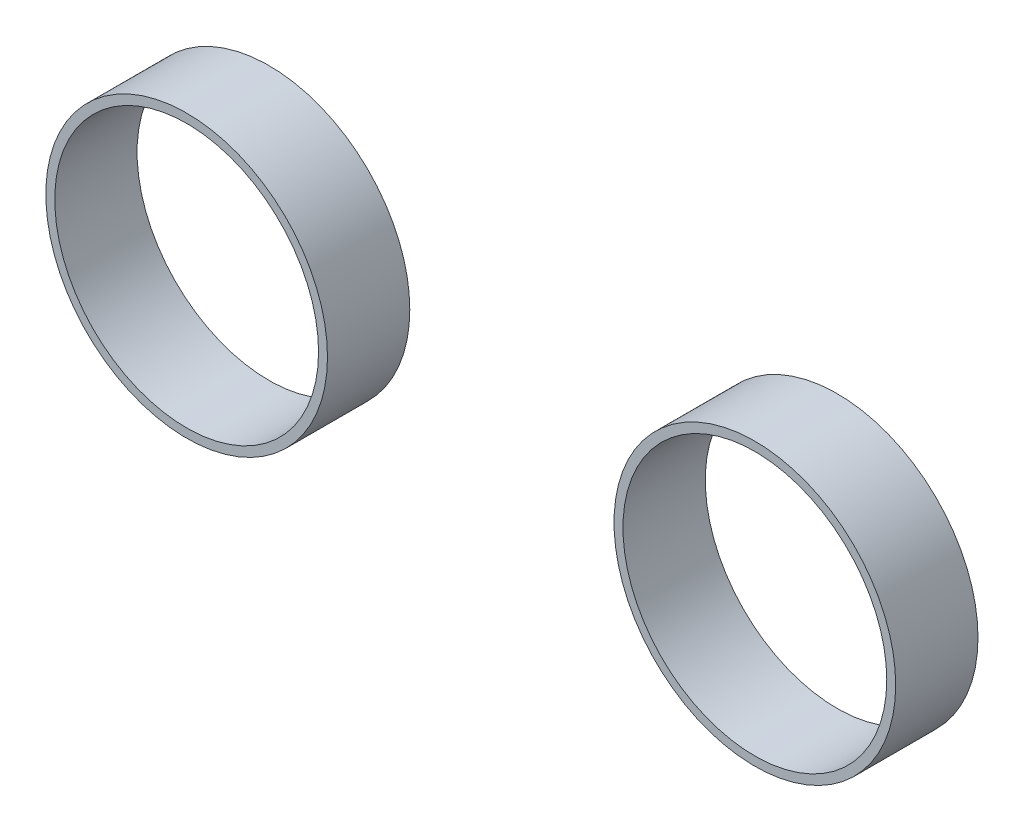
ISO-10303-21;
HEADER;
FILE_DESCRIPTION(('STEP AP214'),'2;1');
FILE_NAME('part.step','',(''),(''),'','','');
FILE_SCHEMA(('AUTOMOTIVE_DESIGN { 1 0 10303 214 1 1 1 1 }'));
ENDSEC;
DATA;
#1=APPLICATION_CONTEXT('core data for automotive mechanical design processes');
#2=APPLICATION_PROTOCOL_DEFINITION('international standard','automotive_design',2000,#1);
#3=PRODUCT_CONTEXT('',#1,'mechanical');
#4=PRODUCT('Part','Part','',(#3));
#5=PRODUCT_RELATED_PRODUCT_CATEGORY('part','',(#4));
#6=PRODUCT_DEFINITION_FORMATION('','',#4);
#7=PRODUCT_DEFINITION_CONTEXT('part definition',#1,'design');
#8=PRODUCT_DEFINITION('design','',#6,#7);
#9=PRODUCT_DEFINITION_SHAPE('','',#8);
#10=(LENGTH_UNIT() NAMED_UNIT(*) SI_UNIT(.MILLI.,.METRE.));
#11=(NAMED_UNIT(*) PLANE_ANGLE_UNIT() SI_UNIT($,.RADIAN.));
#12=(NAMED_UNIT(*) SI_UNIT($,.STERADIAN.) SOLID_ANGLE_UNIT());
#13=UNCERTAINTY_MEASURE_WITH_UNIT(LENGTH_MEASURE(1.E-05),#10,'distance_accuracy_value','');
#14=(GEOMETRIC_REPRESENTATION_CONTEXT(3) GLOBAL_UNCERTAINTY_ASSIGNED_CONTEXT((#13)) GLOBAL_UNIT_ASSIGNED_CONTEXT((#10,
#11,#12)) REPRESENTATION_CONTEXT('',''));
#15=CARTESIAN_POINT('',(0.,0.,0.));
#16=DIRECTION('',(0.,0.,1.));
#17=DIRECTION('',(1.,0.,0.));
#18=AXIS2_PLACEMENT_3D('',#15,#16,#17);
#19=CARTESIAN_POINT('',(1435.9804727587,-423.382336201578,40.56));
#20=DIRECTION('',(0.,0.,1.));
#21=DIRECTION('',(1.,0.,0.));
#22=AXIS2_PLACEMENT_3D('',#19,#20,#21);
#23=PLANE('',#22);
#24=CARTESIAN_POINT('',(1435.9804727587,-423.382336201578,40.56));
#25=DIRECTION('',(0.,0.,1.));
#26=DIRECTION('',(1.,0.,0.));
#27=AXIS2_PLACEMENT_3D('',#24,#25,#26);
#28=CIRCLE('',#27,69.3999999999999);
#29=CARTESIAN_POINT('',(1505.3804727587,-423.382336201578,40.56));
#30=VERTEX_POINT('',#29);
#31=EDGE_CURVE('E60',#30,#30,#28,.T.);
#32=ORIENTED_EDGE('',*,*,#31,.T.);
#33=EDGE_LOOP('',(#32));
#34=FACE_BOUND('',#33,.T.);
#35=CARTESIAN_POINT('',(1435.9804727587,-423.382336201578,40.56));
#36=DIRECTION('',(0.,0.,1.));
#37=DIRECTION('',(1.,0.,0.));
#38=AXIS2_PLACEMENT_3D('',#35,#36,#37);
#39=CIRCLE('',#38,64.9999999999999);
#40=CARTESIAN_POINT('',(1500.9804727587,-423.382336201578,40.56));
#41=VERTEX_POINT('',#40);
#42=EDGE_CURVE('E51',#41,#41,#39,.T.);
#43=ORIENTED_EDGE('',*,*,#42,.F.);
#44=EDGE_LOOP('',(#43));
#45=FACE_BOUND('',#44,.T.);
#46=ADVANCED_FACE('F47',(#34,#45),#23,.T.);
#47=CARTESIAN_POINT('',(1435.9804727587,-423.382336201578,0.));
#48=DIRECTION('',(0.,0.,1.));
#49=DIRECTION('',(1.,0.,0.));
#50=AXIS2_PLACEMENT_3D('',#47,#48,#49);
#51=PLANE('',#50);
#52=CARTESIAN_POINT('',(1435.9804727587,-423.382336201578,0.));
#53=DIRECTION('',(0.,0.,1.));
#54=DIRECTION('',(1.,0.,0.));
#55=AXIS2_PLACEMENT_3D('',#52,#53,#54);
#56=CIRCLE('',#55,69.3999999999999);
#57=CARTESIAN_POINT('',(1505.3804727587,-423.382336201578,0.));
#58=VERTEX_POINT('',#57);
#59=EDGE_CURVE('E58',#58,#58,#56,.T.);
#60=ORIENTED_EDGE('',*,*,#59,.F.);
#61=EDGE_LOOP('',(#60));
#62=FACE_BOUND('',#61,.T.);
#63=CARTESIAN_POINT('',(1435.9804727587,-423.382336201578,0.));
#64=DIRECTION('',(0.,0.,1.));
#65=DIRECTION('',(1.,0.,0.));
#66=AXIS2_PLACEMENT_3D('',#63,#64,#65);
#67=CIRCLE('',#66,64.9999999999999);
#68=CARTESIAN_POINT('',(1500.9804727587,-423.382336201578,0.));
#69=VERTEX_POINT('',#68);
#70=EDGE_CURVE('E11',#69,#69,#67,.T.);
#71=ORIENTED_EDGE('',*,*,#70,.T.);
#72=EDGE_LOOP('',(#71));
#73=FACE_BOUND('',#72,.T.);
#74=ADVANCED_FACE('F68',(#62,#73),#51,.F.);
#75=CARTESIAN_POINT('',(1435.9804727587,-423.382336201578,40.56));
#76=DIRECTION('',(0.,0.,-1.));
#77=DIRECTION('',(-1.,0.,0.));
#78=AXIS2_PLACEMENT_3D('',#75,#76,#77);
#79=CYLINDRICAL_SURFACE('',#78,69.3999999999999);
#80=ORIENTED_EDGE('',*,*,#31,.F.);
#81=EDGE_LOOP('',(#80));
#82=FACE_BOUND('',#81,.T.);
#83=ORIENTED_EDGE('',*,*,#59,.T.);
#84=EDGE_LOOP('',(#83));
#85=FACE_BOUND('',#84,.T.);
#86=ADVANCED_FACE('F66',(#82,#85),#79,.T.);
#87=CARTESIAN_POINT('',(1435.9804727587,-423.382336201578,40.56));
#88=DIRECTION('',(0.,0.,-1.));
#89=DIRECTION('',(-1.,0.,0.));
#90=AXIS2_PLACEMENT_3D('',#87,#88,#89);
#91=CYLINDRICAL_SURFACE('',#90,64.9999999999999);
#92=ORIENTED_EDGE('',*,*,#42,.T.);
#93=EDGE_LOOP('',(#92));
#94=FACE_BOUND('',#93,.T.);
#95=ORIENTED_EDGE('',*,*,#70,.F.);
#96=EDGE_LOOP('',(#95));
#97=FACE_BOUND('',#96,.T.);
#98=ADVANCED_FACE('F49',(#94,#97),#91,.F.);
#99=CLOSED_SHELL('',(#46,#74,#86,#98));
#100=MANIFOLD_SOLID_BREP('B2',#99);
#101=CARTESIAN_POINT('',(1715.9804727587,-423.382336201567,40.56));
#102=DIRECTION('',(0.,0.,1.));
#103=DIRECTION('',(1.,0.,0.));
#104=AXIS2_PLACEMENT_3D('',#101,#102,#103);
#105=PLANE('',#104);
#106=CARTESIAN_POINT('',(1715.9804727587,-423.382336201567,40.56));
#107=DIRECTION('',(0.,0.,1.));
#108=DIRECTION('',(1.,0.,0.));
#109=AXIS2_PLACEMENT_3D('',#106,#107,#108);
#110=CIRCLE('',#109,69.3999999999999);
#111=CARTESIAN_POINT('',(1785.3804727587,-423.382336201567,40.56));
#112=VERTEX_POINT('',#111);
#113=EDGE_CURVE('E46',#112,#112,#110,.T.);
#114=ORIENTED_EDGE('',*,*,#113,.T.);
#115=EDGE_LOOP('',(#114));
#116=FACE_BOUND('',#115,.T.);
#117=CARTESIAN_POINT('',(1715.9804727587,-423.382336201567,40.56));
#118=DIRECTION('',(0.,0.,1.));
#119=DIRECTION('',(1.,0.,0.));
#120=AXIS2_PLACEMENT_3D('',#117,#118,#119);
#121=CIRCLE('',#120,64.9999999999999);
#122=CARTESIAN_POINT('',(1780.9804727587,-423.382336201567,40.56));
#123=VERTEX_POINT('',#122);
#124=EDGE_CURVE('E120',#123,#123,#121,.T.);
#125=ORIENTED_EDGE('',*,*,#124,.F.);
#126=EDGE_LOOP('',(#125));
#127=FACE_BOUND('',#126,.T.);
#128=ADVANCED_FACE('F109',(#116,#127),#105,.T.);
#129=CARTESIAN_POINT('',(1715.9804727587,-423.382336201567,0.));
#130=DIRECTION('',(0.,0.,1.));
#131=DIRECTION('',(1.,0.,0.));
#132=AXIS2_PLACEMENT_3D('',#129,#130,#131);
#133=PLANE('',#132);
#134=CARTESIAN_POINT('',(1715.9804727587,-423.382336201567,0.));
#135=DIRECTION('',(0.,0.,1.));
#136=DIRECTION('',(1.,0.,0.));
#137=AXIS2_PLACEMENT_3D('',#134,#135,#136);
#138=CIRCLE('',#137,69.3999999999999);
#139=CARTESIAN_POINT('',(1785.3804727587,-423.382336201567,0.));
#140=VERTEX_POINT('',#139);
#141=EDGE_CURVE('E113',#140,#140,#138,.T.);
#142=ORIENTED_EDGE('',*,*,#141,.F.);
#143=EDGE_LOOP('',(#142));
#144=FACE_BOUND('',#143,.T.);
#145=CARTESIAN_POINT('',(1715.9804727587,-423.382336201567,0.));
#146=DIRECTION('',(0.,0.,1.));
#147=DIRECTION('',(1.,0.,0.));
#148=AXIS2_PLACEMENT_3D('',#145,#146,#147);
#149=CIRCLE('',#148,64.9999999999999);
#150=CARTESIAN_POINT('',(1780.9804727587,-423.382336201567,0.));
#151=VERTEX_POINT('',#150);
#152=EDGE_CURVE('E122',#151,#151,#149,.T.);
#153=ORIENTED_EDGE('',*,*,#152,.T.);
#154=EDGE_LOOP('',(#153));
#155=FACE_BOUND('',#154,.T.);
#156=ADVANCED_FACE('F132',(#144,#155),#133,.F.);
#157=CARTESIAN_POINT('',(1715.9804727587,-423.382336201567,40.56));
#158=DIRECTION('',(0.,0.,-1.));
#159=DIRECTION('',(-1.,0.,0.));
#160=AXIS2_PLACEMENT_3D('',#157,#158,#159);
#161=CYLINDRICAL_SURFACE('',#160,69.3999999999999);
#162=ORIENTED_EDGE('',*,*,#113,.F.);
#163=EDGE_LOOP('',(#162));
#164=FACE_BOUND('',#163,.T.);
#165=ORIENTED_EDGE('',*,*,#141,.T.);
#166=EDGE_LOOP('',(#165));
#167=FACE_BOUND('',#166,.T.);
#168=ADVANCED_FACE('F111',(#164,#167),#161,.T.);
#169=CARTESIAN_POINT('',(1715.9804727587,-423.382336201567,40.56));
#170=DIRECTION('',(0.,0.,-1.));
#171=DIRECTION('',(-1.,0.,0.));
#172=AXIS2_PLACEMENT_3D('',#169,#170,#171);
#173=CYLINDRICAL_SURFACE('',#172,64.9999999999999);
#174=ORIENTED_EDGE('',*,*,#124,.T.);
#175=EDGE_LOOP('',(#174));
#176=FACE_BOUND('',#175,.T.);
#177=ORIENTED_EDGE('',*,*,#152,.F.);
#178=EDGE_LOOP('',(#177));
#179=FACE_BOUND('',#178,.T.);
#180=ADVANCED_FACE('F128',(#176,#179),#173,.F.);
#181=CLOSED_SHELL('',(#128,#156,#168,#180));
#182=MANIFOLD_SOLID_BREP('B6',#181);
#183=ADVANCED_BREP_SHAPE_REPRESENTATION('',(#18,#100,#182),#14);
#184=SHAPE_DEFINITION_REPRESENTATION(#9,#183);
ENDSEC;
END-ISO-10303-21;
